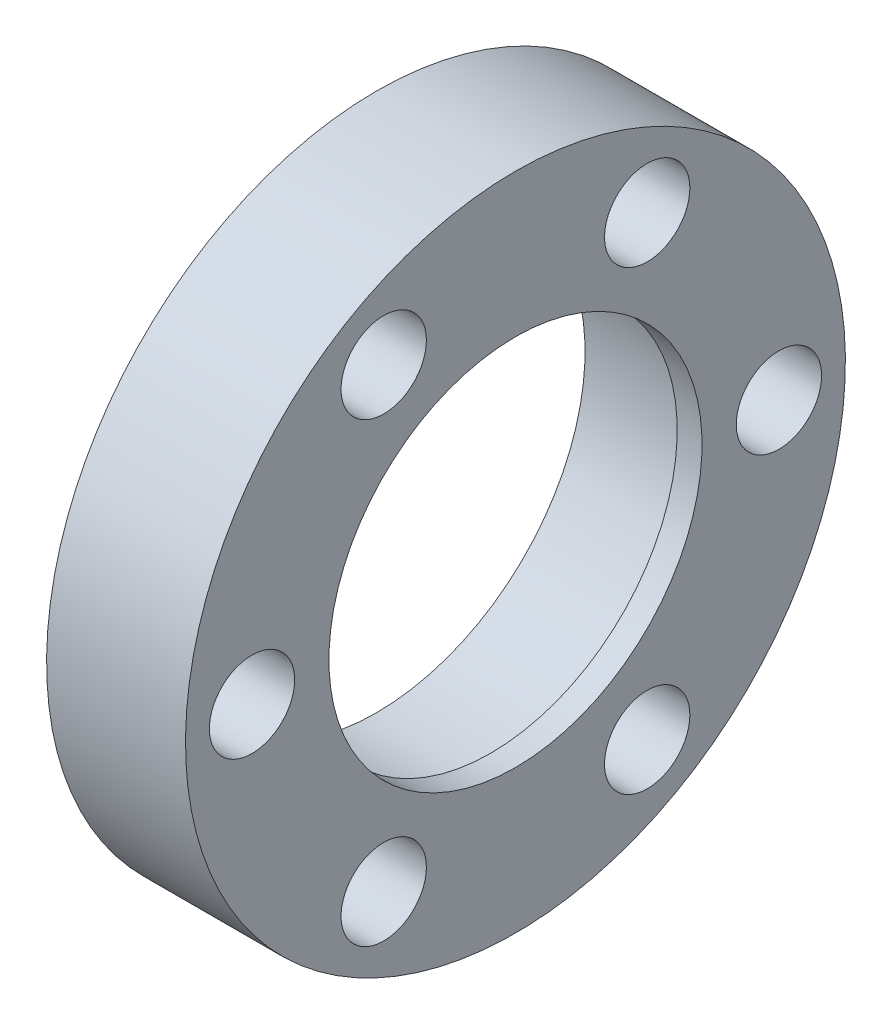
ISO-10303-21;
HEADER;
FILE_DESCRIPTION(('STEP AP214'),'2;1');
FILE_NAME('part.step','',(''),(''),'','','');
FILE_SCHEMA(('AUTOMOTIVE_DESIGN { 1 0 10303 214 1 1 1 1 }'));
ENDSEC;
DATA;
#1=APPLICATION_CONTEXT('core data for automotive mechanical design processes');
#2=APPLICATION_PROTOCOL_DEFINITION('international standard','automotive_design',2000,#1);
#3=PRODUCT_CONTEXT('',#1,'mechanical');
#4=PRODUCT('Part','Part','',(#3));
#5=PRODUCT_RELATED_PRODUCT_CATEGORY('part','',(#4));
#6=PRODUCT_DEFINITION_FORMATION('','',#4);
#7=PRODUCT_DEFINITION_CONTEXT('part definition',#1,'design');
#8=PRODUCT_DEFINITION('design','',#6,#7);
#9=PRODUCT_DEFINITION_SHAPE('','',#8);
#10=(LENGTH_UNIT() NAMED_UNIT(*) SI_UNIT(.MILLI.,.METRE.));
#11=(NAMED_UNIT(*) PLANE_ANGLE_UNIT() SI_UNIT($,.RADIAN.));
#12=(NAMED_UNIT(*) SI_UNIT($,.STERADIAN.) SOLID_ANGLE_UNIT());
#13=UNCERTAINTY_MEASURE_WITH_UNIT(LENGTH_MEASURE(1.E-05),#10,'distance_accuracy_value','');
#14=(GEOMETRIC_REPRESENTATION_CONTEXT(3) GLOBAL_UNCERTAINTY_ASSIGNED_CONTEXT((#13)) GLOBAL_UNIT_ASSIGNED_CONTEXT((#10,
#11,#12)) REPRESENTATION_CONTEXT('',''));
#15=CARTESIAN_POINT('',(0.,0.,0.));
#16=DIRECTION('',(0.,0.,1.));
#17=DIRECTION('',(1.,0.,0.));
#18=AXIS2_PLACEMENT_3D('',#15,#16,#17);
#19=CARTESIAN_POINT('',(5.84199999999898,10.1129000000002,0.));
#20=DIRECTION('',(-1.,0.,0.));
#21=DIRECTION('',(0.,0.,1.));
#22=AXIS2_PLACEMENT_3D('',#19,#20,#21);
#23=PLANE('',#22);
#24=CARTESIAN_POINT('',(5.84199999999899,0.,0.));
#25=DIRECTION('',(1.,0.,0.));
#26=DIRECTION('',(0.,1.,0.));
#27=AXIS2_PLACEMENT_3D('',#24,#25,#26);
#28=CIRCLE('',#27,9.55039999999998);
#29=CARTESIAN_POINT('',(5.84199999999898,9.5504,0.));
#30=VERTEX_POINT('',#29);
#31=EDGE_CURVE('E18',#30,#30,#28,.T.);
#32=ORIENTED_EDGE('',*,*,#31,.T.);
#33=EDGE_LOOP('',(#32));
#34=FACE_BOUND('',#33,.T.);
#35=CARTESIAN_POINT('',(5.84199999999899,0.,0.));
#36=DIRECTION('',(1.,0.,0.));
#37=DIRECTION('',(0.,1.,0.));
#38=AXIS2_PLACEMENT_3D('',#35,#36,#37);
#39=CIRCLE('',#38,10.6754000000004);
#40=CARTESIAN_POINT('',(5.84199999999898,10.6754000000005,0.));
#41=VERTEX_POINT('',#40);
#42=EDGE_CURVE('E70',#41,#41,#39,.F.);
#43=ORIENTED_EDGE('',*,*,#42,.T.);
#44=EDGE_LOOP('',(#43));
#45=FACE_BOUND('',#44,.T.);
#46=ADVANCED_FACE('F14',(#34,#45),#23,.T.);
#47=CARTESIAN_POINT('',(6.47699999999914,0.,0.));
#48=DIRECTION('',(1.,0.,0.));
#49=DIRECTION('',(0.,1.,0.));
#50=AXIS2_PLACEMENT_3D('',#47,#48,#49);
#51=CYLINDRICAL_SURFACE('',#50,9.55039999999998);
#52=CARTESIAN_POINT('',(7.11199999999932,0.,0.));
#53=DIRECTION('',(1.,0.,0.));
#54=DIRECTION('',(0.,1.,0.));
#55=AXIS2_PLACEMENT_3D('',#52,#53,#54);
#56=CIRCLE('',#55,9.55039999999998);
#57=CARTESIAN_POINT('',(7.11199999999932,9.5504,0.));
#58=VERTEX_POINT('',#57);
#59=EDGE_CURVE('E50',#58,#58,#56,.F.);
#60=ORIENTED_EDGE('',*,*,#59,.F.);
#61=EDGE_LOOP('',(#60));
#62=FACE_BOUND('',#61,.T.);
#63=ORIENTED_EDGE('',*,*,#31,.F.);
#64=EDGE_LOOP('',(#63));
#65=FACE_BOUND('',#64,.T.);
#66=ADVANCED_FACE('F78',(#62,#65),#51,.F.);
#67=CARTESIAN_POINT('',(0.,11.6804310310023,-6.7437));
#68=DIRECTION('',(1.,0.,0.));
#69=DIRECTION('',(0.,0.,-1.));
#70=AXIS2_PLACEMENT_3D('',#67,#68,#69);
#71=CYLINDRICAL_SURFACE('',#70,2.18440000000001);
#72=CARTESIAN_POINT('',(0.,11.6804310310023,-6.7437));
#73=DIRECTION('',(1.,0.,0.));
#74=DIRECTION('',(0.,0.,-1.));
#75=AXIS2_PLACEMENT_3D('',#72,#73,#74);
#76=CIRCLE('',#75,2.18440000000001);
#77=CARTESIAN_POINT('',(0.,11.6804310310023,-8.9281));
#78=VERTEX_POINT('',#77);
#79=EDGE_CURVE('E47',#78,#78,#76,.T.);
#80=ORIENTED_EDGE('',*,*,#79,.F.);
#81=EDGE_LOOP('',(#80));
#82=FACE_BOUND('',#81,.T.);
#83=CARTESIAN_POINT('',(7.11199999999932,11.6804310310023,-6.7437));
#84=DIRECTION('',(1.,0.,0.));
#85=DIRECTION('',(0.,0.,-1.));
#86=AXIS2_PLACEMENT_3D('',#83,#84,#85);
#87=CIRCLE('',#86,2.18440000000001);
#88=CARTESIAN_POINT('',(7.11199999999932,11.6804310310023,-8.9281));
#89=VERTEX_POINT('',#88);
#90=EDGE_CURVE('E68',#89,#89,#87,.F.);
#91=ORIENTED_EDGE('',*,*,#90,.F.);
#92=EDGE_LOOP('',(#91));
#93=FACE_BOUND('',#92,.T.);
#94=ADVANCED_FACE('F80',(#82,#93),#71,.F.);
#95=CARTESIAN_POINT('',(0.,0.,-13.4874));
#96=DIRECTION('',(1.,0.,0.));
#97=DIRECTION('',(0.,1.,0.));
#98=AXIS2_PLACEMENT_3D('',#95,#96,#97);
#99=CYLINDRICAL_SURFACE('',#98,2.1844);
#100=CARTESIAN_POINT('',(0.,0.,-13.4874));
#101=DIRECTION('',(1.,0.,0.));
#102=DIRECTION('',(0.,1.,0.));
#103=AXIS2_PLACEMENT_3D('',#100,#101,#102);
#104=CIRCLE('',#103,2.1844);
#105=CARTESIAN_POINT('',(0.,2.18440000000002,-13.4874));
#106=VERTEX_POINT('',#105);
#107=EDGE_CURVE('E44',#106,#106,#104,.T.);
#108=ORIENTED_EDGE('',*,*,#107,.F.);
#109=EDGE_LOOP('',(#108));
#110=FACE_BOUND('',#109,.T.);
#111=CARTESIAN_POINT('',(7.11199999999932,0.,-13.4874));
#112=DIRECTION('',(1.,0.,0.));
#113=DIRECTION('',(0.,1.,0.));
#114=AXIS2_PLACEMENT_3D('',#111,#112,#113);
#115=CIRCLE('',#114,2.1844);
#116=CARTESIAN_POINT('',(7.11199999999932,2.18440000000002,-13.4874));
#117=VERTEX_POINT('',#116);
#118=EDGE_CURVE('E65',#117,#117,#115,.F.);
#119=ORIENTED_EDGE('',*,*,#118,.F.);
#120=EDGE_LOOP('',(#119));
#121=FACE_BOUND('',#120,.T.);
#122=ADVANCED_FACE('F88',(#110,#121),#99,.F.);
#123=CARTESIAN_POINT('',(0.,-11.6804310310022,-6.7437));
#124=DIRECTION('',(1.,0.,0.));
#125=DIRECTION('',(0.,0.,-1.));
#126=AXIS2_PLACEMENT_3D('',#123,#124,#125);
#127=CYLINDRICAL_SURFACE('',#126,2.18440000000001);
#128=CARTESIAN_POINT('',(0.,-11.6804310310022,-6.7437));
#129=DIRECTION('',(1.,0.,0.));
#130=DIRECTION('',(0.,0.,-1.));
#131=AXIS2_PLACEMENT_3D('',#128,#129,#130);
#132=CIRCLE('',#131,2.18440000000001);
#133=CARTESIAN_POINT('',(0.,-11.6804310310022,-8.92810000000001));
#134=VERTEX_POINT('',#133);
#135=EDGE_CURVE('E41',#134,#134,#132,.T.);
#136=ORIENTED_EDGE('',*,*,#135,.F.);
#137=EDGE_LOOP('',(#136));
#138=FACE_BOUND('',#137,.T.);
#139=CARTESIAN_POINT('',(7.11199999999932,-11.6804310310022,-6.7437));
#140=DIRECTION('',(1.,0.,0.));
#141=DIRECTION('',(0.,0.,-1.));
#142=AXIS2_PLACEMENT_3D('',#139,#140,#141);
#143=CIRCLE('',#142,2.18440000000001);
#144=CARTESIAN_POINT('',(7.11199999999932,-11.6804310310022,-8.92810000000001));
#145=VERTEX_POINT('',#144);
#146=EDGE_CURVE('E62',#145,#145,#143,.F.);
#147=ORIENTED_EDGE('',*,*,#146,.F.);
#148=EDGE_LOOP('',(#147));
#149=FACE_BOUND('',#148,.T.);
#150=ADVANCED_FACE('F139',(#138,#149),#127,.F.);
#151=CARTESIAN_POINT('',(0.,-11.6804310310022,6.7437));
#152=DIRECTION('',(1.,0.,0.));
#153=DIRECTION('',(0.,0.,-1.));
#154=AXIS2_PLACEMENT_3D('',#151,#152,#153);
#155=CYLINDRICAL_SURFACE('',#154,2.18440000000001);
#156=CARTESIAN_POINT('',(0.,-11.6804310310022,6.7437));
#157=DIRECTION('',(1.,0.,0.));
#158=DIRECTION('',(0.,0.,-1.));
#159=AXIS2_PLACEMENT_3D('',#156,#157,#158);
#160=CIRCLE('',#159,2.18440000000001);
#161=CARTESIAN_POINT('',(0.,-11.6804310310022,4.55929999999999));
#162=VERTEX_POINT('',#161);
#163=EDGE_CURVE('E38',#162,#162,#160,.T.);
#164=ORIENTED_EDGE('',*,*,#163,.F.);
#165=EDGE_LOOP('',(#164));
#166=FACE_BOUND('',#165,.T.);
#167=CARTESIAN_POINT('',(7.11199999999932,-11.6804310310022,6.7437));
#168=DIRECTION('',(1.,0.,0.));
#169=DIRECTION('',(0.,0.,-1.));
#170=AXIS2_PLACEMENT_3D('',#167,#168,#169);
#171=CIRCLE('',#170,2.18440000000001);
#172=CARTESIAN_POINT('',(7.11199999999932,-11.6804310310022,4.55929999999999));
#173=VERTEX_POINT('',#172);
#174=EDGE_CURVE('E59',#173,#173,#171,.F.);
#175=ORIENTED_EDGE('',*,*,#174,.F.);
#176=EDGE_LOOP('',(#175));
#177=FACE_BOUND('',#176,.T.);
#178=ADVANCED_FACE('F146',(#166,#177),#155,.F.);
#179=CARTESIAN_POINT('',(0.,11.6804310310022,6.74369999999998));
#180=DIRECTION('',(1.,0.,0.));
#181=DIRECTION('',(0.,0.,-1.));
#182=AXIS2_PLACEMENT_3D('',#179,#180,#181);
#183=CYLINDRICAL_SURFACE('',#182,2.18439999999998);
#184=CARTESIAN_POINT('',(0.,11.6804310310022,6.74369999999998));
#185=DIRECTION('',(1.,0.,0.));
#186=DIRECTION('',(0.,0.,-1.));
#187=AXIS2_PLACEMENT_3D('',#184,#185,#186);
#188=CIRCLE('',#187,2.18439999999998);
#189=CARTESIAN_POINT('',(0.,11.6804310310022,4.5593));
#190=VERTEX_POINT('',#189);
#191=EDGE_CURVE('E35',#190,#190,#188,.T.);
#192=ORIENTED_EDGE('',*,*,#191,.F.);
#193=EDGE_LOOP('',(#192));
#194=FACE_BOUND('',#193,.T.);
#195=CARTESIAN_POINT('',(7.11199999999932,11.6804310310022,6.74369999999998));
#196=DIRECTION('',(1.,0.,0.));
#197=DIRECTION('',(0.,0.,-1.));
#198=AXIS2_PLACEMENT_3D('',#195,#196,#197);
#199=CIRCLE('',#198,2.18439999999998);
#200=CARTESIAN_POINT('',(7.11199999999932,11.6804310310022,4.5593));
#201=VERTEX_POINT('',#200);
#202=EDGE_CURVE('E56',#201,#201,#199,.F.);
#203=ORIENTED_EDGE('',*,*,#202,.F.);
#204=EDGE_LOOP('',(#203));
#205=FACE_BOUND('',#204,.T.);
#206=ADVANCED_FACE('F114',(#194,#205),#183,.F.);
#207=CARTESIAN_POINT('',(0.,0.,13.4874));
#208=DIRECTION('',(1.,0.,0.));
#209=DIRECTION('',(0.,1.,0.));
#210=AXIS2_PLACEMENT_3D('',#207,#208,#209);
#211=CYLINDRICAL_SURFACE('',#210,2.1844);
#212=CARTESIAN_POINT('',(0.,0.,13.4874));
#213=DIRECTION('',(1.,0.,0.));
#214=DIRECTION('',(0.,1.,0.));
#215=AXIS2_PLACEMENT_3D('',#212,#213,#214);
#216=CIRCLE('',#215,2.1844);
#217=CARTESIAN_POINT('',(0.,2.18440000000002,13.4874));
#218=VERTEX_POINT('',#217);
#219=EDGE_CURVE('E32',#218,#218,#216,.T.);
#220=ORIENTED_EDGE('',*,*,#219,.F.);
#221=EDGE_LOOP('',(#220));
#222=FACE_BOUND('',#221,.T.);
#223=CARTESIAN_POINT('',(7.11199999999932,0.,13.4874));
#224=DIRECTION('',(1.,0.,0.));
#225=DIRECTION('',(0.,1.,0.));
#226=AXIS2_PLACEMENT_3D('',#223,#224,#225);
#227=CIRCLE('',#226,2.1844);
#228=CARTESIAN_POINT('',(7.11199999999932,2.18440000000002,13.4874));
#229=VERTEX_POINT('',#228);
#230=EDGE_CURVE('E53',#229,#229,#227,.F.);
#231=ORIENTED_EDGE('',*,*,#230,.F.);
#232=EDGE_LOOP('',(#231));
#233=FACE_BOUND('',#232,.T.);
#234=ADVANCED_FACE('F16',(#222,#233),#211,.F.);
#235=CARTESIAN_POINT('',(2.92099999999944,0.,0.));
#236=DIRECTION('',(1.,0.,0.));
#237=DIRECTION('',(0.,1.,0.));
#238=AXIS2_PLACEMENT_3D('',#235,#236,#237);
#239=CYLINDRICAL_SURFACE('',#238,10.6754000000004);
#240=ORIENTED_EDGE('',*,*,#42,.F.);
#241=EDGE_LOOP('',(#240));
#242=FACE_BOUND('',#241,.T.);
#243=CARTESIAN_POINT('',(0.,0.,0.));
#244=DIRECTION('',(1.,0.,0.));
#245=DIRECTION('',(0.,1.,0.));
#246=AXIS2_PLACEMENT_3D('',#243,#244,#245);
#247=CIRCLE('',#246,10.6754000000004);
#248=CARTESIAN_POINT('',(0.,10.6754000000005,0.));
#249=VERTEX_POINT('',#248);
#250=EDGE_CURVE('E27',#249,#249,#247,.T.);
#251=ORIENTED_EDGE('',*,*,#250,.F.);
#252=EDGE_LOOP('',(#251));
#253=FACE_BOUND('',#252,.T.);
#254=ADVANCED_FACE('F107',(#242,#253),#239,.F.);
#255=CARTESIAN_POINT('',(7.11199999999932,13.2207000000003,0.));
#256=DIRECTION('',(1.,0.,0.));
#257=DIRECTION('',(0.,0.,-1.));
#258=AXIS2_PLACEMENT_3D('',#255,#256,#257);
#259=PLANE('',#258);
#260=ORIENTED_EDGE('',*,*,#59,.T.);
#261=EDGE_LOOP('',(#260));
#262=FACE_BOUND('',#261,.T.);
#263=ORIENTED_EDGE('',*,*,#230,.T.);
#264=EDGE_LOOP('',(#263));
#265=FACE_BOUND('',#264,.T.);
#266=ORIENTED_EDGE('',*,*,#202,.T.);
#267=EDGE_LOOP('',(#266));
#268=FACE_BOUND('',#267,.T.);
#269=ORIENTED_EDGE('',*,*,#174,.T.);
#270=EDGE_LOOP('',(#269));
#271=FACE_BOUND('',#270,.T.);
#272=ORIENTED_EDGE('',*,*,#146,.T.);
#273=EDGE_LOOP('',(#272));
#274=FACE_BOUND('',#273,.T.);
#275=ORIENTED_EDGE('',*,*,#118,.T.);
#276=EDGE_LOOP('',(#275));
#277=FACE_BOUND('',#276,.T.);
#278=ORIENTED_EDGE('',*,*,#90,.T.);
#279=EDGE_LOOP('',(#278));
#280=FACE_BOUND('',#279,.T.);
#281=CARTESIAN_POINT('',(7.11199999999932,0.,0.));
#282=DIRECTION('',(1.,0.,0.));
#283=DIRECTION('',(0.,1.,0.));
#284=AXIS2_PLACEMENT_3D('',#281,#282,#283);
#285=CIRCLE('',#284,16.8910000000005);
#286=CARTESIAN_POINT('',(7.11199999999932,16.8910000000005,0.));
#287=VERTEX_POINT('',#286);
#288=EDGE_CURVE('E22',#287,#287,#285,.F.);
#289=ORIENTED_EDGE('',*,*,#288,.F.);
#290=EDGE_LOOP('',(#289));
#291=FACE_BOUND('',#290,.T.);
#292=ADVANCED_FACE('F101',(#262,#265,#268,#271,#274,#277,#280,#291),#259,.T.);
#293=CARTESIAN_POINT('',(0.,13.7832000000005,0.));
#294=DIRECTION('',(-1.,0.,0.));
#295=DIRECTION('',(0.,0.,1.));
#296=AXIS2_PLACEMENT_3D('',#293,#294,#295);
#297=PLANE('',#296);
#298=ORIENTED_EDGE('',*,*,#250,.T.);
#299=EDGE_LOOP('',(#298));
#300=FACE_BOUND('',#299,.T.);
#301=ORIENTED_EDGE('',*,*,#219,.T.);
#302=EDGE_LOOP('',(#301));
#303=FACE_BOUND('',#302,.T.);
#304=ORIENTED_EDGE('',*,*,#191,.T.);
#305=EDGE_LOOP('',(#304));
#306=FACE_BOUND('',#305,.T.);
#307=ORIENTED_EDGE('',*,*,#163,.T.);
#308=EDGE_LOOP('',(#307));
#309=FACE_BOUND('',#308,.T.);
#310=ORIENTED_EDGE('',*,*,#135,.T.);
#311=EDGE_LOOP('',(#310));
#312=FACE_BOUND('',#311,.T.);
#313=ORIENTED_EDGE('',*,*,#107,.T.);
#314=EDGE_LOOP('',(#313));
#315=FACE_BOUND('',#314,.T.);
#316=ORIENTED_EDGE('',*,*,#79,.T.);
#317=EDGE_LOOP('',(#316));
#318=FACE_BOUND('',#317,.T.);
#319=CARTESIAN_POINT('',(0.,0.,0.));
#320=DIRECTION('',(1.,0.,0.));
#321=DIRECTION('',(0.,1.,0.));
#322=AXIS2_PLACEMENT_3D('',#319,#320,#321);
#323=CIRCLE('',#322,16.8910000000005);
#324=CARTESIAN_POINT('',(0.,16.8910000000005,0.));
#325=VERTEX_POINT('',#324);
#326=EDGE_CURVE('E10',#325,#325,#323,.T.);
#327=ORIENTED_EDGE('',*,*,#326,.F.);
#328=EDGE_LOOP('',(#327));
#329=FACE_BOUND('',#328,.T.);
#330=ADVANCED_FACE('F96',(#300,#303,#306,#309,#312,#315,#318,#329),#297,.T.);
#331=CARTESIAN_POINT('',(3.55599999999962,0.,0.));
#332=DIRECTION('',(1.,0.,0.));
#333=DIRECTION('',(0.,1.,0.));
#334=AXIS2_PLACEMENT_3D('',#331,#332,#333);
#335=CYLINDRICAL_SURFACE('',#334,16.8910000000005);
#336=ORIENTED_EDGE('',*,*,#326,.T.);
#337=EDGE_LOOP('',(#336));
#338=FACE_BOUND('',#337,.T.);
#339=ORIENTED_EDGE('',*,*,#288,.T.);
#340=EDGE_LOOP('',(#339));
#341=FACE_BOUND('',#340,.T.);
#342=ADVANCED_FACE('F94',(#338,#341),#335,.T.);
#343=CLOSED_SHELL('',(#46,#66,#94,#122,#150,#178,#206,#234,#254,#292,#330,#342));
#344=MANIFOLD_SOLID_BREP('B1',#343);
#345=ADVANCED_BREP_SHAPE_REPRESENTATION('',(#18,#344),#14);
#346=SHAPE_DEFINITION_REPRESENTATION(#9,#345);
ENDSEC;
END-ISO-10303-21;
